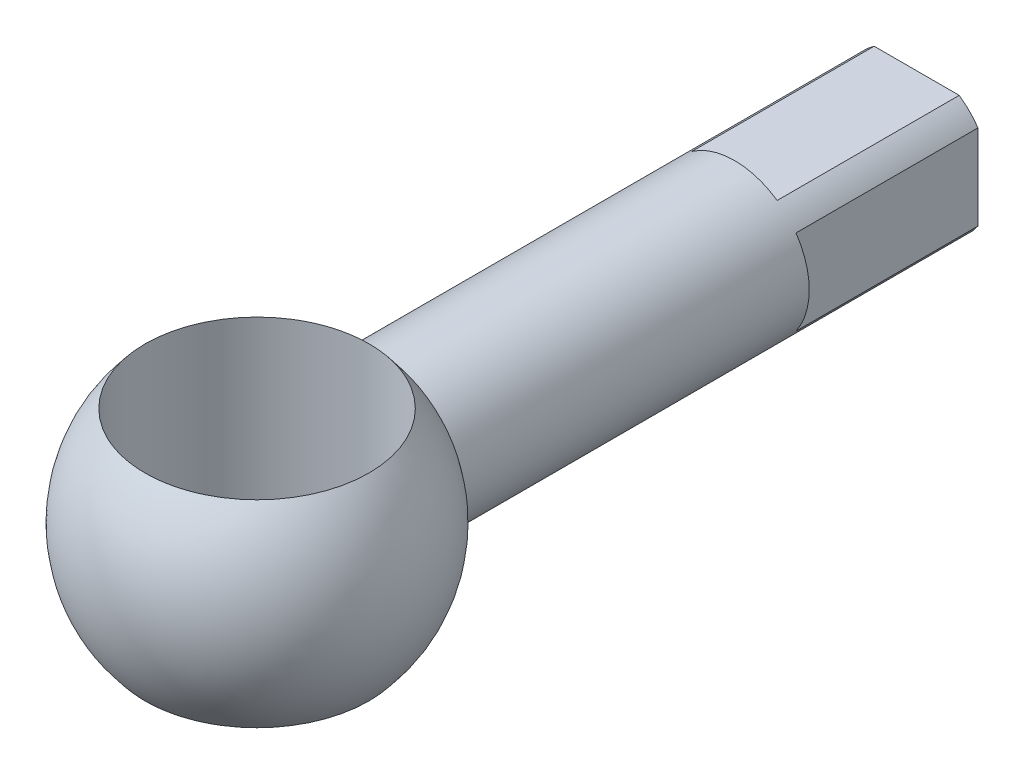
ISO-10303-21;
HEADER;
FILE_DESCRIPTION(('STEP AP214'),'2;1');
FILE_NAME('part.step','',(''),(''),'','','');
FILE_SCHEMA(('AUTOMOTIVE_DESIGN { 1 0 10303 214 1 1 1 1 }'));
ENDSEC;
DATA;
#1=APPLICATION_CONTEXT('core data for automotive mechanical design processes');
#2=APPLICATION_PROTOCOL_DEFINITION('international standard','automotive_design',2000,#1);
#3=PRODUCT_CONTEXT('',#1,'mechanical');
#4=PRODUCT('Part','Part','',(#3));
#5=PRODUCT_RELATED_PRODUCT_CATEGORY('part','',(#4));
#6=PRODUCT_DEFINITION_FORMATION('','',#4);
#7=PRODUCT_DEFINITION_CONTEXT('part definition',#1,'design');
#8=PRODUCT_DEFINITION('design','',#6,#7);
#9=PRODUCT_DEFINITION_SHAPE('','',#8);
#10=(LENGTH_UNIT() NAMED_UNIT(*) SI_UNIT(.MILLI.,.METRE.));
#11=(NAMED_UNIT(*) PLANE_ANGLE_UNIT() SI_UNIT($,.RADIAN.));
#12=(NAMED_UNIT(*) SI_UNIT($,.STERADIAN.) SOLID_ANGLE_UNIT());
#13=UNCERTAINTY_MEASURE_WITH_UNIT(LENGTH_MEASURE(1.E-05),#10,'distance_accuracy_value','');
#14=(GEOMETRIC_REPRESENTATION_CONTEXT(3) GLOBAL_UNCERTAINTY_ASSIGNED_CONTEXT((#13)) GLOBAL_UNIT_ASSIGNED_CONTEXT((#10,
#11,#12)) REPRESENTATION_CONTEXT('',''));
#15=CARTESIAN_POINT('',(0.,0.,0.));
#16=DIRECTION('',(0.,0.,1.));
#17=DIRECTION('',(1.,0.,0.));
#18=AXIS2_PLACEMENT_3D('',#15,#16,#17);
#19=CARTESIAN_POINT('',(0.,0.,-72.7974964028778));
#20=DIRECTION('',(0.,0.,-1.));
#21=DIRECTION('',(-1.,0.,0.));
#22=AXIS2_PLACEMENT_3D('',#19,#20,#21);
#23=PLANE('',#22);
#24=DIRECTION('',(1.,0.,0.));
#25=VECTOR('',#24,1.);
#26=CARTESIAN_POINT('',(7.239,-10.4348875892364,-72.7974964028778));
#27=LINE('',#26,#25);
#28=CARTESIAN_POINT('',(-7.239,-10.4348875892364,-72.7974964028778));
#29=VERTEX_POINT('',#28);
#30=CARTESIAN_POINT('',(7.239,-10.4348875892364,-72.7974964028778));
#31=VERTEX_POINT('',#30);
#32=EDGE_CURVE('E111',#29,#31,#27,.T.);
#33=ORIENTED_EDGE('',*,*,#32,.F.);
#34=CARTESIAN_POINT('',(0.,0.,-72.7974964028778));
#35=DIRECTION('',(0.,0.,-1.));
#36=DIRECTION('',(-1.,0.,0.));
#37=AXIS2_PLACEMENT_3D('',#34,#35,#36);
#38=CIRCLE('',#37,12.7);
#39=CARTESIAN_POINT('',(-10.4348875892364,-7.239,-72.7974964028778));
#40=VERTEX_POINT('',#39);
#41=EDGE_CURVE('E50',#29,#40,#38,.T.);
#42=ORIENTED_EDGE('',*,*,#41,.T.);
#43=DIRECTION('',(0.,-1.,0.));
#44=VECTOR('',#43,1.);
#45=CARTESIAN_POINT('',(-10.4348875892364,7.239,-72.7974964028778));
#46=LINE('',#45,#44);
#47=CARTESIAN_POINT('',(-10.4348875892364,7.239,-72.7974964028778));
#48=VERTEX_POINT('',#47);
#49=EDGE_CURVE('E135',#48,#40,#46,.T.);
#50=ORIENTED_EDGE('',*,*,#49,.F.);
#51=CARTESIAN_POINT('',(-7.239,10.4348875892364,-72.7974964028778));
#52=VERTEX_POINT('',#51);
#53=EDGE_CURVE('E11',#48,#52,#38,.T.);
#54=ORIENTED_EDGE('',*,*,#53,.T.);
#55=DIRECTION('',(-1.,0.,0.));
#56=VECTOR('',#55,1.);
#57=CARTESIAN_POINT('',(7.239,10.4348875892364,-72.7974964028778));
#58=LINE('',#57,#56);
#59=CARTESIAN_POINT('',(7.239,10.4348875892364,-72.7974964028778));
#60=VERTEX_POINT('',#59);
#61=EDGE_CURVE('E167',#60,#52,#58,.T.);
#62=ORIENTED_EDGE('',*,*,#61,.F.);
#63=CARTESIAN_POINT('',(10.4348875892364,7.239,-72.7974964028778));
#64=VERTEX_POINT('',#63);
#65=EDGE_CURVE('E48',#60,#64,#38,.T.);
#66=ORIENTED_EDGE('',*,*,#65,.T.);
#67=DIRECTION('',(0.,1.,0.));
#68=VECTOR('',#67,1.);
#69=CARTESIAN_POINT('',(10.4348875892364,7.239,-72.7974964028778));
#70=LINE('',#69,#68);
#71=CARTESIAN_POINT('',(10.4348875892364,-7.239,-72.7974964028778));
#72=VERTEX_POINT('',#71);
#73=EDGE_CURVE('E151',#72,#64,#70,.T.);
#74=ORIENTED_EDGE('',*,*,#73,.F.);
#75=EDGE_CURVE('E312',#72,#31,#38,.T.);
#76=ORIENTED_EDGE('',*,*,#75,.T.);
#77=EDGE_LOOP('',(#33,#42,#50,#54,#62,#66,#74,#76));
#78=FACE_BOUND('',#77,.T.);
#79=ADVANCED_FACE('F39',(#78),#23,.T.);
#80=CARTESIAN_POINT('',(0.,0.,-52.4446043165467));
#81=DIRECTION('',(0.,0.,-1.));
#82=DIRECTION('',(-1.,0.,0.));
#83=AXIS2_PLACEMENT_3D('',#80,#81,#82);
#84=CYLINDRICAL_SURFACE('',#83,12.7);
#85=DIRECTION('',(0.,0.,-1.));
#86=VECTOR('',#85,1.);
#87=CARTESIAN_POINT('',(7.239,-10.4348875892364,-41.8094964028778));
#88=LINE('',#87,#86);
#89=CARTESIAN_POINT('',(7.23899999999999,-10.4348875892364,-41.8094964028778));
#90=VERTEX_POINT('',#89);
#91=EDGE_CURVE('E117',#90,#31,#88,.T.);
#92=ORIENTED_EDGE('',*,*,#91,.T.);
#93=ORIENTED_EDGE('',*,*,#75,.F.);
#94=DIRECTION('',(0.,0.,-1.));
#95=VECTOR('',#94,1.);
#96=CARTESIAN_POINT('',(10.4348875892364,-7.239,-41.8094964028778));
#97=LINE('',#96,#95);
#98=CARTESIAN_POINT('',(10.4348875892364,-7.239,-41.8094964028778));
#99=VERTEX_POINT('',#98);
#100=EDGE_CURVE('E154',#99,#72,#97,.T.);
#101=ORIENTED_EDGE('',*,*,#100,.F.);
#102=CARTESIAN_POINT('',(0.,0.,-41.8094964028778));
#103=DIRECTION('',(0.,0.,-1.));
#104=DIRECTION('',(-1.,0.,0.));
#105=AXIS2_PLACEMENT_3D('',#102,#103,#104);
#106=CIRCLE('',#105,12.7);
#107=CARTESIAN_POINT('',(10.4348875892364,7.23899999999999,-41.8094964028778));
#108=VERTEX_POINT('',#107);
#109=EDGE_CURVE('E147',#108,#99,#106,.T.);
#110=ORIENTED_EDGE('',*,*,#109,.F.);
#111=DIRECTION('',(0.,0.,-1.));
#112=VECTOR('',#111,1.);
#113=CARTESIAN_POINT('',(10.4348875892364,7.239,-41.8094964028778));
#114=LINE('',#113,#112);
#115=EDGE_CURVE('E141',#108,#64,#114,.T.);
#116=ORIENTED_EDGE('',*,*,#115,.T.);
#117=ORIENTED_EDGE('',*,*,#65,.F.);
#118=DIRECTION('',(0.,0.,-1.));
#119=VECTOR('',#118,1.);
#120=CARTESIAN_POINT('',(7.239,10.4348875892364,-41.8094964028778));
#121=LINE('',#120,#119);
#122=CARTESIAN_POINT('',(7.239,10.4348875892364,-41.8094964028778));
#123=VERTEX_POINT('',#122);
#124=EDGE_CURVE('E170',#123,#60,#121,.T.);
#125=ORIENTED_EDGE('',*,*,#124,.F.);
#126=CARTESIAN_POINT('',(0.,0.,-41.8094964028778));
#127=DIRECTION('',(0.,0.,-1.));
#128=DIRECTION('',(-1.,0.,0.));
#129=AXIS2_PLACEMENT_3D('',#126,#127,#128);
#130=CIRCLE('',#129,12.7);
#131=CARTESIAN_POINT('',(-7.23899999999999,10.4348875892364,-41.8094964028778));
#132=VERTEX_POINT('',#131);
#133=EDGE_CURVE('E163',#132,#123,#130,.T.);
#134=ORIENTED_EDGE('',*,*,#133,.F.);
#135=DIRECTION('',(0.,0.,-1.));
#136=VECTOR('',#135,1.);
#137=CARTESIAN_POINT('',(-7.239,10.4348875892364,-41.8094964028778));
#138=LINE('',#137,#136);
#139=EDGE_CURVE('E157',#132,#52,#138,.T.);
#140=ORIENTED_EDGE('',*,*,#139,.T.);
#141=ORIENTED_EDGE('',*,*,#53,.F.);
#142=DIRECTION('',(0.,0.,-1.));
#143=VECTOR('',#142,1.);
#144=CARTESIAN_POINT('',(-10.4348875892364,7.239,-41.8094964028778));
#145=LINE('',#144,#143);
#146=CARTESIAN_POINT('',(-10.4348875892364,7.239,-41.8094964028778));
#147=VERTEX_POINT('',#146);
#148=EDGE_CURVE('E138',#147,#48,#145,.T.);
#149=ORIENTED_EDGE('',*,*,#148,.F.);
#150=CARTESIAN_POINT('',(0.,0.,-41.8094964028778));
#151=DIRECTION('',(0.,0.,-1.));
#152=DIRECTION('',(-1.,0.,0.));
#153=AXIS2_PLACEMENT_3D('',#150,#151,#152);
#154=CIRCLE('',#153,12.7);
#155=CARTESIAN_POINT('',(-10.4348875892364,-7.23899999999999,-41.8094964028778));
#156=VERTEX_POINT('',#155);
#157=EDGE_CURVE('E132',#156,#147,#154,.T.);
#158=ORIENTED_EDGE('',*,*,#157,.F.);
#159=DIRECTION('',(0.,0.,-1.));
#160=VECTOR('',#159,1.);
#161=CARTESIAN_POINT('',(-10.4348875892364,-7.239,-41.8094964028778));
#162=LINE('',#161,#160);
#163=EDGE_CURVE('E142',#156,#40,#162,.T.);
#164=ORIENTED_EDGE('',*,*,#163,.T.);
#165=ORIENTED_EDGE('',*,*,#41,.F.);
#166=DIRECTION('',(0.,0.,-1.));
#167=VECTOR('',#166,1.);
#168=CARTESIAN_POINT('',(-7.239,-10.4348875892364,-41.8094964028778));
#169=LINE('',#168,#167);
#170=CARTESIAN_POINT('',(-7.239,-10.4348875892364,-41.8094964028778));
#171=VERTEX_POINT('',#170);
#172=EDGE_CURVE('E115',#171,#29,#169,.T.);
#173=ORIENTED_EDGE('',*,*,#172,.F.);
#174=CARTESIAN_POINT('',(0.,0.,-41.8094964028778));
#175=DIRECTION('',(0.,0.,-1.));
#176=DIRECTION('',(-1.,0.,0.));
#177=AXIS2_PLACEMENT_3D('',#174,#175,#176);
#178=CIRCLE('',#177,12.7);
#179=EDGE_CURVE('E105',#90,#171,#178,.T.);
#180=ORIENTED_EDGE('',*,*,#179,.F.);
#181=EDGE_LOOP('',(#92,#93,#101,#110,#116,#117,#125,#134,#140,#141,#149,#158,#164,#165,#173,#180));
#182=FACE_BOUND('',#181,.T.);
#183=CARTESIAN_POINT('',(0.,0.,17.4734583409974));
#184=DIRECTION('',(0.,0.,-1.));
#185=DIRECTION('',(-1.,0.,0.));
#186=AXIS2_PLACEMENT_3D('',#183,#184,#185);
#187=CIRCLE('',#186,12.7);
#188=CARTESIAN_POINT('',(-12.7,0.,17.4734583409974));
#189=VERTEX_POINT('',#188);
#190=EDGE_CURVE('E178',#189,#189,#187,.T.);
#191=ORIENTED_EDGE('',*,*,#190,.T.);
#192=EDGE_LOOP('',(#191));
#193=FACE_BOUND('',#192,.T.);
#194=ADVANCED_FACE('F121',(#182,#193),#84,.T.);
#195=CARTESIAN_POINT('',(0.,0.,39.4705035971222));
#196=DIRECTION('',(0.,0.,-1.));
#197=DIRECTION('',(-1.,0.,0.));
#198=AXIS2_PLACEMENT_3D('',#195,#196,#197);
#199=SPHERICAL_SURFACE('',#198,25.4);
#200=CARTESIAN_POINT('',(0.,16.8005208252601,39.4705035971222));
#201=DIRECTION('',(0.,-1.,0.));
#202=DIRECTION('',(0.,0.,-1.));
#203=AXIS2_PLACEMENT_3D('',#200,#201,#202);
#204=CIRCLE('',#203,19.05);
#205=CARTESIAN_POINT('',(0.,16.8005208252601,20.4205035971222));
#206=VERTEX_POINT('',#205);
#207=EDGE_CURVE('E42',#206,#206,#204,.F.);
#208=ORIENTED_EDGE('',*,*,#207,.F.);
#209=EDGE_LOOP('',(#208));
#210=FACE_BOUND('',#209,.T.);
#211=CARTESIAN_POINT('',(0.,-16.8005208252601,39.4705035971222));
#212=DIRECTION('',(0.,1.,0.));
#213=DIRECTION('',(0.,0.,1.));
#214=AXIS2_PLACEMENT_3D('',#211,#212,#213);
#215=CIRCLE('',#214,19.05);
#216=CARTESIAN_POINT('',(0.,-16.8005208252601,58.5205035971222));
#217=VERTEX_POINT('',#216);
#218=EDGE_CURVE('E128',#217,#217,#215,.F.);
#219=ORIENTED_EDGE('',*,*,#218,.F.);
#220=EDGE_LOOP('',(#219));
#221=FACE_BOUND('',#220,.T.);
#222=ORIENTED_EDGE('',*,*,#190,.F.);
#223=EDGE_LOOP('',(#222));
#224=FACE_BOUND('',#223,.T.);
#225=ADVANCED_FACE('F191',(#210,#221,#224),#199,.T.);
#226=CARTESIAN_POINT('',(0.,-25.4,39.4705035971222));
#227=DIRECTION('',(0.,1.,0.));
#228=DIRECTION('',(0.,0.,1.));
#229=AXIS2_PLACEMENT_3D('',#226,#227,#228);
#230=CYLINDRICAL_SURFACE('',#229,19.05);
#231=ORIENTED_EDGE('',*,*,#207,.T.);
#232=EDGE_LOOP('',(#231));
#233=FACE_BOUND('',#232,.T.);
#234=ORIENTED_EDGE('',*,*,#218,.T.);
#235=EDGE_LOOP('',(#234));
#236=FACE_BOUND('',#235,.T.);
#237=ADVANCED_FACE('F189',(#233,#236),#230,.F.);
#238=CARTESIAN_POINT('',(7.239,10.4348875892364,-41.8094964028778));
#239=DIRECTION('',(0.,-1.,0.));
#240=DIRECTION('',(0.,0.,-1.));
#241=AXIS2_PLACEMENT_3D('',#238,#239,#240);
#242=PLANE('',#241);
#243=ORIENTED_EDGE('',*,*,#61,.T.);
#244=ORIENTED_EDGE('',*,*,#139,.F.);
#245=DIRECTION('',(-1.,0.,0.));
#246=VECTOR('',#245,1.);
#247=CARTESIAN_POINT('',(7.239,10.4348875892364,-41.8094964028778));
#248=LINE('',#247,#246);
#249=EDGE_CURVE('E166',#123,#132,#248,.T.);
#250=ORIENTED_EDGE('',*,*,#249,.F.);
#251=ORIENTED_EDGE('',*,*,#124,.T.);
#252=EDGE_LOOP('',(#243,#244,#250,#251));
#253=FACE_BOUND('',#252,.T.);
#254=ADVANCED_FACE('F205',(#253),#242,.F.);
#255=CARTESIAN_POINT('',(0.,0.,-41.8094964028778));
#256=DIRECTION('',(0.,0.,-1.));
#257=DIRECTION('',(-1.,0.,0.));
#258=AXIS2_PLACEMENT_3D('',#255,#256,#257);
#259=PLANE('',#258);
#260=ORIENTED_EDGE('',*,*,#133,.T.);
#261=ORIENTED_EDGE('',*,*,#249,.T.);
#262=EDGE_LOOP('',(#260,#261));
#263=FACE_BOUND('',#262,.T.);
#264=ADVANCED_FACE('F208',(#263),#259,.T.);
#265=CARTESIAN_POINT('',(10.4348875892364,7.239,-41.8094964028778));
#266=DIRECTION('',(-1.,0.,0.));
#267=DIRECTION('',(0.,-1.,0.));
#268=AXIS2_PLACEMENT_3D('',#265,#266,#267);
#269=PLANE('',#268);
#270=ORIENTED_EDGE('',*,*,#73,.T.);
#271=ORIENTED_EDGE('',*,*,#115,.F.);
#272=DIRECTION('',(0.,1.,0.));
#273=VECTOR('',#272,1.);
#274=CARTESIAN_POINT('',(10.4348875892364,7.239,-41.8094964028778));
#275=LINE('',#274,#273);
#276=EDGE_CURVE('E150',#99,#108,#275,.T.);
#277=ORIENTED_EDGE('',*,*,#276,.F.);
#278=ORIENTED_EDGE('',*,*,#100,.T.);
#279=EDGE_LOOP('',(#270,#271,#277,#278));
#280=FACE_BOUND('',#279,.T.);
#281=ADVANCED_FACE('F212',(#280),#269,.F.);
#282=CARTESIAN_POINT('',(0.,0.,-41.8094964028778));
#283=DIRECTION('',(0.,0.,-1.));
#284=DIRECTION('',(-1.,0.,0.));
#285=AXIS2_PLACEMENT_3D('',#282,#283,#284);
#286=PLANE('',#285);
#287=ORIENTED_EDGE('',*,*,#109,.T.);
#288=ORIENTED_EDGE('',*,*,#276,.T.);
#289=EDGE_LOOP('',(#287,#288));
#290=FACE_BOUND('',#289,.T.);
#291=ADVANCED_FACE('F216',(#290),#286,.T.);
#292=CARTESIAN_POINT('',(-10.4348875892364,7.239,-41.8094964028778));
#293=DIRECTION('',(1.,0.,0.));
#294=DIRECTION('',(0.,0.,-1.));
#295=AXIS2_PLACEMENT_3D('',#292,#293,#294);
#296=PLANE('',#295);
#297=ORIENTED_EDGE('',*,*,#49,.T.);
#298=ORIENTED_EDGE('',*,*,#163,.F.);
#299=DIRECTION('',(0.,-1.,0.));
#300=VECTOR('',#299,1.);
#301=CARTESIAN_POINT('',(-10.4348875892364,7.239,-41.8094964028778));
#302=LINE('',#301,#300);
#303=EDGE_CURVE('E63',#147,#156,#302,.T.);
#304=ORIENTED_EDGE('',*,*,#303,.F.);
#305=ORIENTED_EDGE('',*,*,#148,.T.);
#306=EDGE_LOOP('',(#297,#298,#304,#305));
#307=FACE_BOUND('',#306,.T.);
#308=ADVANCED_FACE('F220',(#307),#296,.F.);
#309=CARTESIAN_POINT('',(0.,0.,-41.8094964028778));
#310=DIRECTION('',(0.,0.,-1.));
#311=DIRECTION('',(-1.,0.,0.));
#312=AXIS2_PLACEMENT_3D('',#309,#310,#311);
#313=PLANE('',#312);
#314=ORIENTED_EDGE('',*,*,#157,.T.);
#315=ORIENTED_EDGE('',*,*,#303,.T.);
#316=EDGE_LOOP('',(#314,#315));
#317=FACE_BOUND('',#316,.T.);
#318=ADVANCED_FACE('F224',(#317),#313,.T.);
#319=CARTESIAN_POINT('',(7.239,-10.4348875892364,-41.8094964028778));
#320=DIRECTION('',(0.,1.,0.));
#321=DIRECTION('',(0.,0.,1.));
#322=AXIS2_PLACEMENT_3D('',#319,#320,#321);
#323=PLANE('',#322);
#324=ORIENTED_EDGE('',*,*,#32,.T.);
#325=ORIENTED_EDGE('',*,*,#91,.F.);
#326=DIRECTION('',(1.,0.,0.));
#327=VECTOR('',#326,1.);
#328=CARTESIAN_POINT('',(7.239,-10.4348875892364,-41.8094964028778));
#329=LINE('',#328,#327);
#330=EDGE_CURVE('E56',#171,#90,#329,.T.);
#331=ORIENTED_EDGE('',*,*,#330,.F.);
#332=ORIENTED_EDGE('',*,*,#172,.T.);
#333=EDGE_LOOP('',(#324,#325,#331,#332));
#334=FACE_BOUND('',#333,.T.);
#335=ADVANCED_FACE('F114',(#334),#323,.F.);
#336=CARTESIAN_POINT('',(0.,0.,-41.8094964028778));
#337=DIRECTION('',(0.,0.,-1.));
#338=DIRECTION('',(-1.,0.,0.));
#339=AXIS2_PLACEMENT_3D('',#336,#337,#338);
#340=PLANE('',#339);
#341=ORIENTED_EDGE('',*,*,#179,.T.);
#342=ORIENTED_EDGE('',*,*,#330,.T.);
#343=EDGE_LOOP('',(#341,#342));
#344=FACE_BOUND('',#343,.T.);
#345=ADVANCED_FACE('F106',(#344),#340,.T.);
#346=CLOSED_SHELL('',(#79,#194,#225,#237,#254,#264,#281,#291,#308,#318,#335,#345));
#347=MANIFOLD_SOLID_BREP('B2',#346);
#348=ADVANCED_BREP_SHAPE_REPRESENTATION('',(#18,#347),#14);
#349=SHAPE_DEFINITION_REPRESENTATION(#9,#348);
ENDSEC;
END-ISO-10303-21;
